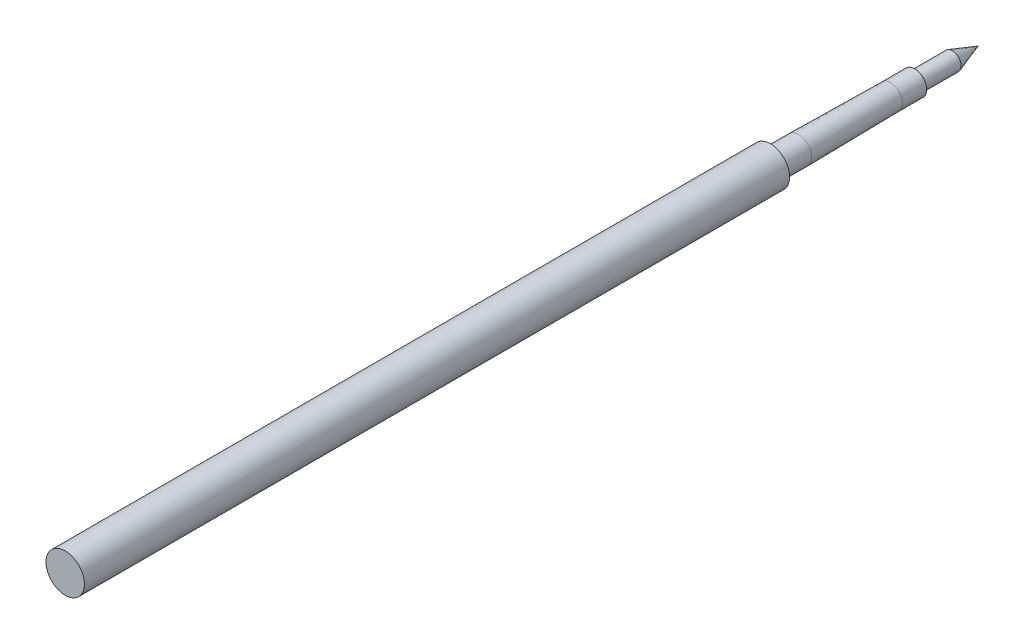
ISO-10303-21;
HEADER;
FILE_DESCRIPTION(('STEP AP214'),'2;1');
FILE_NAME('part.step','',(''),(''),'','','');
FILE_SCHEMA(('AUTOMOTIVE_DESIGN { 1 0 10303 214 1 1 1 1 }'));
ENDSEC;
DATA;
#1=APPLICATION_CONTEXT('core data for automotive mechanical design processes');
#2=APPLICATION_PROTOCOL_DEFINITION('international standard','automotive_design',2000,#1);
#3=PRODUCT_CONTEXT('',#1,'mechanical');
#4=PRODUCT('Part','Part','',(#3));
#5=PRODUCT_RELATED_PRODUCT_CATEGORY('part','',(#4));
#6=PRODUCT_DEFINITION_FORMATION('','',#4);
#7=PRODUCT_DEFINITION_CONTEXT('part definition',#1,'design');
#8=PRODUCT_DEFINITION('design','',#6,#7);
#9=PRODUCT_DEFINITION_SHAPE('','',#8);
#10=(LENGTH_UNIT() NAMED_UNIT(*) SI_UNIT(.MILLI.,.METRE.));
#11=(NAMED_UNIT(*) PLANE_ANGLE_UNIT() SI_UNIT($,.RADIAN.));
#12=(NAMED_UNIT(*) SI_UNIT($,.STERADIAN.) SOLID_ANGLE_UNIT());
#13=UNCERTAINTY_MEASURE_WITH_UNIT(LENGTH_MEASURE(1.E-05),#10,'distance_accuracy_value','');
#14=(GEOMETRIC_REPRESENTATION_CONTEXT(3) GLOBAL_UNCERTAINTY_ASSIGNED_CONTEXT((#13)) GLOBAL_UNIT_ASSIGNED_CONTEXT((#10,
#11,#12)) REPRESENTATION_CONTEXT('',''));
#15=CARTESIAN_POINT('',(0.,0.,0.));
#16=DIRECTION('',(0.,0.,1.));
#17=DIRECTION('',(1.,0.,0.));
#18=AXIS2_PLACEMENT_3D('',#15,#16,#17);
#19=CARTESIAN_POINT('',(0.,0.,0.));
#20=DIRECTION('',(0.,0.,-1.));
#21=DIRECTION('',(-1.,0.,0.));
#22=AXIS2_PLACEMENT_3D('',#19,#20,#21);
#23=PLANE('',#22);
#24=CARTESIAN_POINT('',(0.,0.,0.));
#25=DIRECTION('',(0.,0.,1.));
#26=DIRECTION('',(1.,0.,0.));
#27=AXIS2_PLACEMENT_3D('',#24,#25,#26);
#28=CIRCLE('',#27,2.4);
#29=CARTESIAN_POINT('',(2.4,0.,0.));
#30=VERTEX_POINT('',#29);
#31=EDGE_CURVE('E11',#30,#30,#28,.T.);
#32=ORIENTED_EDGE('',*,*,#31,.T.);
#33=EDGE_LOOP('',(#32));
#34=FACE_BOUND('',#33,.T.);
#35=ADVANCED_FACE('F39',(#34),#23,.F.);
#36=CARTESIAN_POINT('',(0.,0.,0.));
#37=DIRECTION('',(0.,0.,1.));
#38=DIRECTION('',(1.,0.,0.));
#39=AXIS2_PLACEMENT_3D('',#36,#37,#38);
#40=CYLINDRICAL_SURFACE('',#39,2.4);
#41=ORIENTED_EDGE('',*,*,#31,.F.);
#42=EDGE_LOOP('',(#41));
#43=FACE_BOUND('',#42,.T.);
#44=CARTESIAN_POINT('',(0.,0.,-88.));
#45=DIRECTION('',(0.,0.,1.));
#46=DIRECTION('',(1.,0.,0.));
#47=AXIS2_PLACEMENT_3D('',#44,#45,#46);
#48=CIRCLE('',#47,2.4);
#49=CARTESIAN_POINT('',(2.4,0.,-88.));
#50=VERTEX_POINT('',#49);
#51=EDGE_CURVE('E46',#50,#50,#48,.T.);
#52=ORIENTED_EDGE('',*,*,#51,.T.);
#53=EDGE_LOOP('',(#52));
#54=FACE_BOUND('',#53,.T.);
#55=ADVANCED_FACE('F62',(#43,#54),#40,.T.);
#56=CARTESIAN_POINT('',(-2.4,0.,-88.));
#57=DIRECTION('',(0.,0.,1.));
#58=DIRECTION('',(1.,0.,0.));
#59=AXIS2_PLACEMENT_3D('',#56,#57,#58);
#60=PLANE('',#59);
#61=ORIENTED_EDGE('',*,*,#51,.F.);
#62=EDGE_LOOP('',(#61));
#63=FACE_BOUND('',#62,.T.);
#64=CARTESIAN_POINT('',(0.,0.,-88.));
#65=DIRECTION('',(0.,0.,1.));
#66=DIRECTION('',(1.,0.,0.));
#67=AXIS2_PLACEMENT_3D('',#64,#65,#66);
#68=CIRCLE('',#67,1.65);
#69=CARTESIAN_POINT('',(1.65,0.,-88.));
#70=VERTEX_POINT('',#69);
#71=EDGE_CURVE('E75',#70,#70,#68,.T.);
#72=ORIENTED_EDGE('',*,*,#71,.T.);
#73=EDGE_LOOP('',(#72));
#74=FACE_BOUND('',#73,.T.);
#75=ADVANCED_FACE('F67',(#63,#74),#60,.F.);
#76=CARTESIAN_POINT('',(0.,0.,0.));
#77=DIRECTION('',(0.,0.,1.));
#78=DIRECTION('',(1.,0.,0.));
#79=AXIS2_PLACEMENT_3D('',#76,#77,#78);
#80=CYLINDRICAL_SURFACE('',#79,1.65);
#81=ORIENTED_EDGE('',*,*,#71,.F.);
#82=EDGE_LOOP('',(#81));
#83=FACE_BOUND('',#82,.T.);
#84=CARTESIAN_POINT('',(0.,0.,-91.5));
#85=DIRECTION('',(0.,0.,1.));
#86=DIRECTION('',(1.,0.,0.));
#87=AXIS2_PLACEMENT_3D('',#84,#85,#86);
#88=CIRCLE('',#87,1.65);
#89=CARTESIAN_POINT('',(1.65,0.,-91.5));
#90=VERTEX_POINT('',#89);
#91=EDGE_CURVE('E78',#90,#90,#88,.T.);
#92=ORIENTED_EDGE('',*,*,#91,.T.);
#93=EDGE_LOOP('',(#92));
#94=FACE_BOUND('',#93,.T.);
#95=ADVANCED_FACE('F116',(#83,#94),#80,.T.);
#96=CARTESIAN_POINT('',(0.,0.,-103.));
#97=DIRECTION('',(0.,0.,1.));
#98=DIRECTION('',(1.,0.,0.));
#99=AXIS2_PLACEMENT_3D('',#96,#97,#98);
#100=CONICAL_SURFACE('',#99,1.5,0.0130427386306076);
#101=ORIENTED_EDGE('',*,*,#91,.F.);
#102=EDGE_LOOP('',(#101));
#103=FACE_BOUND('',#102,.T.);
#104=CARTESIAN_POINT('',(0.,0.,-103.));
#105=DIRECTION('',(0.,0.,1.));
#106=DIRECTION('',(1.,0.,0.));
#107=AXIS2_PLACEMENT_3D('',#104,#105,#106);
#108=CIRCLE('',#107,1.5);
#109=CARTESIAN_POINT('',(1.5,0.,-103.));
#110=VERTEX_POINT('',#109);
#111=EDGE_CURVE('E84',#110,#110,#108,.T.);
#112=ORIENTED_EDGE('',*,*,#111,.T.);
#113=EDGE_LOOP('',(#112));
#114=FACE_BOUND('',#113,.T.);
#115=ADVANCED_FACE('F109',(#103,#114),#100,.T.);
#116=CARTESIAN_POINT('',(0.,0.,0.));
#117=DIRECTION('',(0.,0.,1.));
#118=DIRECTION('',(1.,0.,0.));
#119=AXIS2_PLACEMENT_3D('',#116,#117,#118);
#120=CYLINDRICAL_SURFACE('',#119,1.5);
#121=ORIENTED_EDGE('',*,*,#111,.F.);
#122=EDGE_LOOP('',(#121));
#123=FACE_BOUND('',#122,.T.);
#124=CARTESIAN_POINT('',(0.,0.,-106.));
#125=DIRECTION('',(0.,0.,1.));
#126=DIRECTION('',(1.,0.,0.));
#127=AXIS2_PLACEMENT_3D('',#124,#125,#126);
#128=CIRCLE('',#127,1.5);
#129=CARTESIAN_POINT('',(1.5,0.,-106.));
#130=VERTEX_POINT('',#129);
#131=EDGE_CURVE('E88',#130,#130,#128,.T.);
#132=ORIENTED_EDGE('',*,*,#131,.T.);
#133=EDGE_LOOP('',(#132));
#134=FACE_BOUND('',#133,.T.);
#135=ADVANCED_FACE('F103',(#123,#134),#120,.T.);
#136=CARTESIAN_POINT('',(-1.5,0.,-106.));
#137=DIRECTION('',(0.,0.,1.));
#138=DIRECTION('',(1.,0.,0.));
#139=AXIS2_PLACEMENT_3D('',#136,#137,#138);
#140=PLANE('',#139);
#141=ORIENTED_EDGE('',*,*,#131,.F.);
#142=EDGE_LOOP('',(#141));
#143=FACE_BOUND('',#142,.T.);
#144=CARTESIAN_POINT('',(0.,0.,-106.));
#145=DIRECTION('',(0.,0.,1.));
#146=DIRECTION('',(1.,0.,0.));
#147=AXIS2_PLACEMENT_3D('',#144,#145,#146);
#148=CIRCLE('',#147,1.1);
#149=CARTESIAN_POINT('',(1.1,0.,-106.));
#150=VERTEX_POINT('',#149);
#151=EDGE_CURVE('E92',#150,#150,#148,.T.);
#152=ORIENTED_EDGE('',*,*,#151,.T.);
#153=EDGE_LOOP('',(#152));
#154=FACE_BOUND('',#153,.T.);
#155=ADVANCED_FACE('F57',(#143,#154),#140,.F.);
#156=CARTESIAN_POINT('',(0.,0.,0.));
#157=DIRECTION('',(0.,0.,1.));
#158=DIRECTION('',(1.,0.,0.));
#159=AXIS2_PLACEMENT_3D('',#156,#157,#158);
#160=CYLINDRICAL_SURFACE('',#159,1.1);
#161=ORIENTED_EDGE('',*,*,#151,.F.);
#162=EDGE_LOOP('',(#161));
#163=FACE_BOUND('',#162,.T.);
#164=CARTESIAN_POINT('',(0.,0.,-110.7));
#165=DIRECTION('',(0.,0.,1.));
#166=DIRECTION('',(1.,0.,0.));
#167=AXIS2_PLACEMENT_3D('',#164,#165,#166);
#168=CIRCLE('',#167,1.1);
#169=CARTESIAN_POINT('',(1.1,0.,-110.7));
#170=VERTEX_POINT('',#169);
#171=EDGE_CURVE('E96',#170,#170,#168,.T.);
#172=ORIENTED_EDGE('',*,*,#171,.T.);
#173=EDGE_LOOP('',(#172));
#174=FACE_BOUND('',#173,.T.);
#175=ADVANCED_FACE('F51',(#163,#174),#160,.T.);
#176=CARTESIAN_POINT('',(0.,0.,-113.9));
#177=DIRECTION('',(0.,0.,1.));
#178=DIRECTION('',(1.,0.,0.));
#179=AXIS2_PLACEMENT_3D('',#176,#177,#178);
#180=CONICAL_SURFACE('',#179,0.,0.331096076704131);
#181=ORIENTED_EDGE('',*,*,#171,.F.);
#182=EDGE_LOOP('',(#181));
#183=FACE_BOUND('',#182,.T.);
#184=CARTESIAN_POINT('',(0.,0.,-113.9));
#185=VERTEX_POINT('',#184);
#186=VERTEX_LOOP('',#185);
#187=FACE_BOUND('',#186,.T.);
#188=ADVANCED_FACE('F49',(#183,#187),#180,.T.);
#189=CLOSED_SHELL('',(#35,#55,#75,#95,#115,#135,#155,#175,#188));
#190=MANIFOLD_SOLID_BREP('B2',#189);
#191=ADVANCED_BREP_SHAPE_REPRESENTATION('',(#18,#190),#14);
#192=SHAPE_DEFINITION_REPRESENTATION(#9,#191);
ENDSEC;
END-ISO-10303-21;
